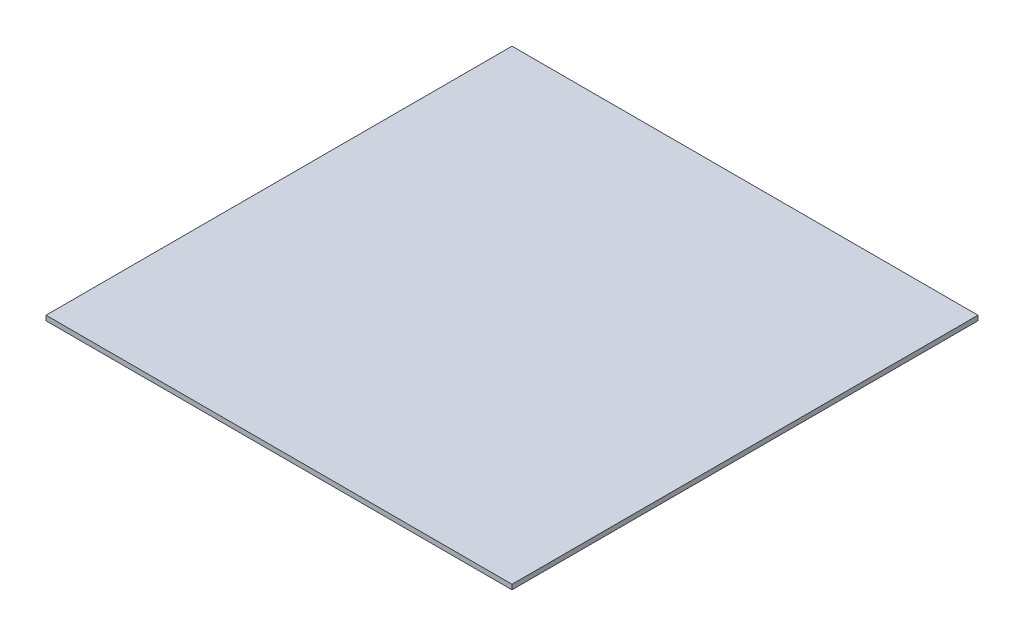
ISO-10303-21;
HEADER;
FILE_DESCRIPTION(('STEP AP214'),'2;1');
FILE_NAME('part.step','',(''),(''),'','','');
FILE_SCHEMA(('AUTOMOTIVE_DESIGN { 1 0 10303 214 1 1 1 1 }'));
ENDSEC;
DATA;
#1=APPLICATION_CONTEXT('core data for automotive mechanical design processes');
#2=APPLICATION_PROTOCOL_DEFINITION('international standard','automotive_design',2000,#1);
#3=PRODUCT_CONTEXT('',#1,'mechanical');
#4=PRODUCT('Part','Part','',(#3));
#5=PRODUCT_RELATED_PRODUCT_CATEGORY('part','',(#4));
#6=PRODUCT_DEFINITION_FORMATION('','',#4);
#7=PRODUCT_DEFINITION_CONTEXT('part definition',#1,'design');
#8=PRODUCT_DEFINITION('design','',#6,#7);
#9=PRODUCT_DEFINITION_SHAPE('','',#8);
#10=(LENGTH_UNIT() NAMED_UNIT(*) SI_UNIT(.MILLI.,.METRE.));
#11=(NAMED_UNIT(*) PLANE_ANGLE_UNIT() SI_UNIT($,.RADIAN.));
#12=(NAMED_UNIT(*) SI_UNIT($,.STERADIAN.) SOLID_ANGLE_UNIT());
#13=UNCERTAINTY_MEASURE_WITH_UNIT(LENGTH_MEASURE(1.E-05),#10,'distance_accuracy_value','');
#14=(GEOMETRIC_REPRESENTATION_CONTEXT(3) GLOBAL_UNCERTAINTY_ASSIGNED_CONTEXT((#13)) GLOBAL_UNIT_ASSIGNED_CONTEXT((#10,
#11,#12)) REPRESENTATION_CONTEXT('',''));
#15=CARTESIAN_POINT('',(0.,0.,0.));
#16=DIRECTION('',(0.,0.,1.));
#17=DIRECTION('',(1.,0.,0.));
#18=AXIS2_PLACEMENT_3D('',#15,#16,#17);
#19=CARTESIAN_POINT('',(-304.8,6.35,304.8));
#20=DIRECTION('',(1.,0.,0.));
#21=DIRECTION('',(0.,0.,-1.));
#22=AXIS2_PLACEMENT_3D('',#19,#20,#21);
#23=PLANE('',#22);
#24=DIRECTION('',(0.,0.,1.));
#25=VECTOR('',#24,1.);
#26=CARTESIAN_POINT('',(-304.8,0.,304.8));
#27=LINE('',#26,#25);
#28=CARTESIAN_POINT('',(-304.8,0.,-304.8));
#29=VERTEX_POINT('',#28);
#30=CARTESIAN_POINT('',(-304.8,0.,304.8));
#31=VERTEX_POINT('',#30);
#32=EDGE_CURVE('E97',#29,#31,#27,.T.);
#33=ORIENTED_EDGE('',*,*,#32,.T.);
#34=DIRECTION('',(0.,-1.,0.));
#35=VECTOR('',#34,1.);
#36=CARTESIAN_POINT('',(-304.8,6.35,304.8));
#37=LINE('',#36,#35);
#38=CARTESIAN_POINT('',(-304.8,6.35,304.8));
#39=VERTEX_POINT('',#38);
#40=EDGE_CURVE('E11',#39,#31,#37,.T.);
#41=ORIENTED_EDGE('',*,*,#40,.F.);
#42=DIRECTION('',(0.,0.,1.));
#43=VECTOR('',#42,1.);
#44=CARTESIAN_POINT('',(-304.8,6.35,304.8));
#45=LINE('',#44,#43);
#46=CARTESIAN_POINT('',(-304.8,6.35,-304.8));
#47=VERTEX_POINT('',#46);
#48=EDGE_CURVE('E85',#47,#39,#45,.T.);
#49=ORIENTED_EDGE('',*,*,#48,.F.);
#50=DIRECTION('',(0.,-1.,0.));
#51=VECTOR('',#50,1.);
#52=CARTESIAN_POINT('',(-304.8,6.35,-304.8));
#53=LINE('',#52,#51);
#54=EDGE_CURVE('E93',#47,#29,#53,.T.);
#55=ORIENTED_EDGE('',*,*,#54,.T.);
#56=EDGE_LOOP('',(#33,#41,#49,#55));
#57=FACE_BOUND('',#56,.T.);
#58=ADVANCED_FACE('F34',(#57),#23,.F.);
#59=CARTESIAN_POINT('',(-304.8,6.35,304.8));
#60=DIRECTION('',(0.,0.,-1.));
#61=DIRECTION('',(-1.,0.,0.));
#62=AXIS2_PLACEMENT_3D('',#59,#60,#61);
#63=PLANE('',#62);
#64=DIRECTION('',(1.,0.,0.));
#65=VECTOR('',#64,1.);
#66=CARTESIAN_POINT('',(-304.8,0.,304.8));
#67=LINE('',#66,#65);
#68=CARTESIAN_POINT('',(304.8,0.,304.8));
#69=VERTEX_POINT('',#68);
#70=EDGE_CURVE('E89',#31,#69,#67,.T.);
#71=ORIENTED_EDGE('',*,*,#70,.T.);
#72=DIRECTION('',(0.,-1.,0.));
#73=VECTOR('',#72,1.);
#74=CARTESIAN_POINT('',(304.8,6.35,304.8));
#75=LINE('',#74,#73);
#76=CARTESIAN_POINT('',(304.8,6.35,304.8));
#77=VERTEX_POINT('',#76);
#78=EDGE_CURVE('E42',#77,#69,#75,.T.);
#79=ORIENTED_EDGE('',*,*,#78,.F.);
#80=DIRECTION('',(1.,0.,0.));
#81=VECTOR('',#80,1.);
#82=CARTESIAN_POINT('',(-304.8,6.35,304.8));
#83=LINE('',#82,#81);
#84=EDGE_CURVE('E80',#39,#77,#83,.T.);
#85=ORIENTED_EDGE('',*,*,#84,.F.);
#86=ORIENTED_EDGE('',*,*,#40,.T.);
#87=EDGE_LOOP('',(#71,#79,#85,#86));
#88=FACE_BOUND('',#87,.T.);
#89=ADVANCED_FACE('F88',(#88),#63,.F.);
#90=CARTESIAN_POINT('',(304.8,6.35,304.8));
#91=DIRECTION('',(-1.,0.,0.));
#92=DIRECTION('',(0.,0.,1.));
#93=AXIS2_PLACEMENT_3D('',#90,#91,#92);
#94=PLANE('',#93);
#95=DIRECTION('',(0.,0.,-1.));
#96=VECTOR('',#95,1.);
#97=CARTESIAN_POINT('',(304.8,0.,304.8));
#98=LINE('',#97,#96);
#99=CARTESIAN_POINT('',(304.8,0.,-304.8));
#100=VERTEX_POINT('',#99);
#101=EDGE_CURVE('E67',#69,#100,#98,.T.);
#102=ORIENTED_EDGE('',*,*,#101,.T.);
#103=DIRECTION('',(0.,-1.,0.));
#104=VECTOR('',#103,1.);
#105=CARTESIAN_POINT('',(304.8,6.35,-304.8));
#106=LINE('',#105,#104);
#107=CARTESIAN_POINT('',(304.8,6.35,-304.8));
#108=VERTEX_POINT('',#107);
#109=EDGE_CURVE('E90',#108,#100,#106,.T.);
#110=ORIENTED_EDGE('',*,*,#109,.F.);
#111=DIRECTION('',(0.,0.,-1.));
#112=VECTOR('',#111,1.);
#113=CARTESIAN_POINT('',(304.8,6.35,304.8));
#114=LINE('',#113,#112);
#115=EDGE_CURVE('E83',#77,#108,#114,.T.);
#116=ORIENTED_EDGE('',*,*,#115,.F.);
#117=ORIENTED_EDGE('',*,*,#78,.T.);
#118=EDGE_LOOP('',(#102,#110,#116,#117));
#119=FACE_BOUND('',#118,.T.);
#120=ADVANCED_FACE('F91',(#119),#94,.F.);
#121=CARTESIAN_POINT('',(-304.8,6.35,-304.8));
#122=DIRECTION('',(0.,0.,1.));
#123=DIRECTION('',(1.,0.,0.));
#124=AXIS2_PLACEMENT_3D('',#121,#122,#123);
#125=PLANE('',#124);
#126=DIRECTION('',(-1.,0.,0.));
#127=VECTOR('',#126,1.);
#128=CARTESIAN_POINT('',(-304.8,0.,-304.8));
#129=LINE('',#128,#127);
#130=EDGE_CURVE('E73',#100,#29,#129,.T.);
#131=ORIENTED_EDGE('',*,*,#130,.T.);
#132=ORIENTED_EDGE('',*,*,#54,.F.);
#133=DIRECTION('',(-1.,0.,0.));
#134=VECTOR('',#133,1.);
#135=CARTESIAN_POINT('',(-304.8,6.35,-304.8));
#136=LINE('',#135,#134);
#137=EDGE_CURVE('E50',#108,#47,#136,.T.);
#138=ORIENTED_EDGE('',*,*,#137,.F.);
#139=ORIENTED_EDGE('',*,*,#109,.T.);
#140=EDGE_LOOP('',(#131,#132,#138,#139));
#141=FACE_BOUND('',#140,.T.);
#142=ADVANCED_FACE('F104',(#141),#125,.F.);
#143=CARTESIAN_POINT('',(0.,6.35,0.));
#144=DIRECTION('',(0.,-1.,0.));
#145=DIRECTION('',(0.,0.,-1.));
#146=AXIS2_PLACEMENT_3D('',#143,#144,#145);
#147=PLANE('',#146);
#148=ORIENTED_EDGE('',*,*,#48,.T.);
#149=ORIENTED_EDGE('',*,*,#84,.T.);
#150=ORIENTED_EDGE('',*,*,#115,.T.);
#151=ORIENTED_EDGE('',*,*,#137,.T.);
#152=EDGE_LOOP('',(#148,#149,#150,#151));
#153=FACE_BOUND('',#152,.T.);
#154=ADVANCED_FACE('F81',(#153),#147,.F.);
#155=CARTESIAN_POINT('',(0.,0.,0.));
#156=DIRECTION('',(0.,-1.,0.));
#157=DIRECTION('',(0.,0.,-1.));
#158=AXIS2_PLACEMENT_3D('',#155,#156,#157);
#159=PLANE('',#158);
#160=ORIENTED_EDGE('',*,*,#32,.F.);
#161=ORIENTED_EDGE('',*,*,#130,.F.);
#162=ORIENTED_EDGE('',*,*,#101,.F.);
#163=ORIENTED_EDGE('',*,*,#70,.F.);
#164=EDGE_LOOP('',(#160,#161,#162,#163));
#165=FACE_BOUND('',#164,.T.);
#166=ADVANCED_FACE('F107',(#165),#159,.T.);
#167=CLOSED_SHELL('',(#58,#89,#120,#142,#154,#166));
#168=MANIFOLD_SOLID_BREP('B2',#167);
#169=ADVANCED_BREP_SHAPE_REPRESENTATION('',(#18,#168),#14);
#170=SHAPE_DEFINITION_REPRESENTATION(#9,#169);
ENDSEC;
END-ISO-10303-21;
